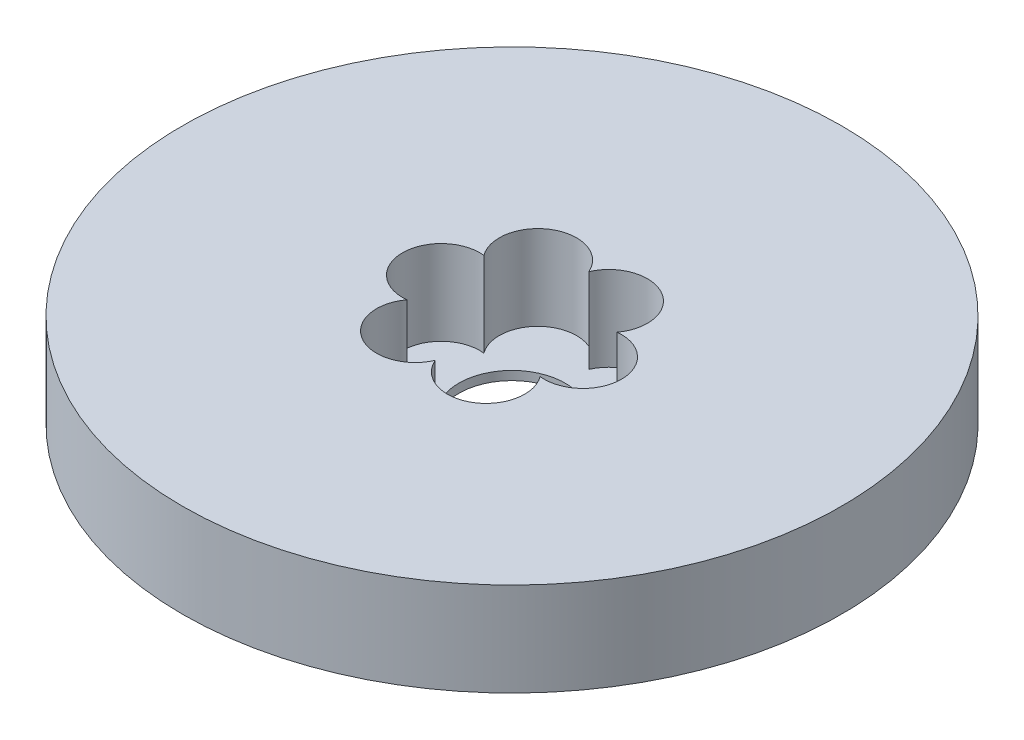
ISO-10303-21;
HEADER;
FILE_DESCRIPTION(('STEP AP214'),'2;1');
FILE_NAME('part.step','',(''),(''),'','','');
FILE_SCHEMA(('AUTOMOTIVE_DESIGN { 1 0 10303 214 1 1 1 1 }'));
ENDSEC;
DATA;
#1=APPLICATION_CONTEXT('core data for automotive mechanical design processes');
#2=APPLICATION_PROTOCOL_DEFINITION('international standard','automotive_design',2000,#1);
#3=PRODUCT_CONTEXT('',#1,'mechanical');
#4=PRODUCT('Part','Part','',(#3));
#5=PRODUCT_RELATED_PRODUCT_CATEGORY('part','',(#4));
#6=PRODUCT_DEFINITION_FORMATION('','',#4);
#7=PRODUCT_DEFINITION_CONTEXT('part definition',#1,'design');
#8=PRODUCT_DEFINITION('design','',#6,#7);
#9=PRODUCT_DEFINITION_SHAPE('','',#8);
#10=(LENGTH_UNIT() NAMED_UNIT(*) SI_UNIT(.MILLI.,.METRE.));
#11=(NAMED_UNIT(*) PLANE_ANGLE_UNIT() SI_UNIT($,.RADIAN.));
#12=(NAMED_UNIT(*) SI_UNIT($,.STERADIAN.) SOLID_ANGLE_UNIT());
#13=UNCERTAINTY_MEASURE_WITH_UNIT(LENGTH_MEASURE(1.E-05),#10,'distance_accuracy_value','');
#14=(GEOMETRIC_REPRESENTATION_CONTEXT(3) GLOBAL_UNCERTAINTY_ASSIGNED_CONTEXT((#13)) GLOBAL_UNIT_ASSIGNED_CONTEXT((#10,
#11,#12)) REPRESENTATION_CONTEXT('',''));
#15=CARTESIAN_POINT('',(0.,0.,0.));
#16=DIRECTION('',(0.,0.,1.));
#17=DIRECTION('',(1.,0.,0.));
#18=AXIS2_PLACEMENT_3D('',#15,#16,#17);
#19=CARTESIAN_POINT('',(0.,22.,0.));
#20=DIRECTION('',(0.,-1.,0.));
#21=DIRECTION('',(0.,0.,-1.));
#22=AXIS2_PLACEMENT_3D('',#19,#20,#21);
#23=CYLINDRICAL_SURFACE('',#22,12.5);
#24=CARTESIAN_POINT('',(0.,0.,0.));
#25=DIRECTION('',(0.,1.,0.));
#26=DIRECTION('',(0.,0.,1.));
#27=AXIS2_PLACEMENT_3D('',#24,#25,#26);
#28=CIRCLE('',#27,12.5);
#29=CARTESIAN_POINT('',(0.,0.,12.5));
#30=VERTEX_POINT('',#29);
#31=EDGE_CURVE('E142',#30,#30,#28,.T.);
#32=ORIENTED_EDGE('',*,*,#31,.F.);
#33=EDGE_LOOP('',(#32));
#34=FACE_BOUND('',#33,.T.);
#35=CARTESIAN_POINT('',(0.,2.08446523954327,0.));
#36=DIRECTION('',(0.,1.,0.));
#37=DIRECTION('',(0.,0.,1.));
#38=AXIS2_PLACEMENT_3D('',#35,#36,#37);
#39=CIRCLE('',#38,12.5);
#40=CARTESIAN_POINT('',(0.,2.08446523954327,12.5));
#41=VERTEX_POINT('',#40);
#42=EDGE_CURVE('E11',#41,#41,#39,.T.);
#43=ORIENTED_EDGE('',*,*,#42,.T.);
#44=EDGE_LOOP('',(#43));
#45=FACE_BOUND('',#44,.T.);
#46=ADVANCED_FACE('F39',(#34,#45),#23,.F.);
#47=CARTESIAN_POINT('',(0.,22.,0.));
#48=DIRECTION('',(0.,-1.,0.));
#49=DIRECTION('',(0.,0.,-1.));
#50=AXIS2_PLACEMENT_3D('',#47,#48,#49);
#51=CYLINDRICAL_SURFACE('',#50,77.5);
#52=CARTESIAN_POINT('',(0.,22.,0.));
#53=DIRECTION('',(0.,1.,0.));
#54=DIRECTION('',(0.,0.,1.));
#55=AXIS2_PLACEMENT_3D('',#52,#53,#54);
#56=CIRCLE('',#55,77.5);
#57=CARTESIAN_POINT('',(0.,22.,77.5));
#58=VERTEX_POINT('',#57);
#59=EDGE_CURVE('E50',#58,#58,#56,.T.);
#60=ORIENTED_EDGE('',*,*,#59,.F.);
#61=EDGE_LOOP('',(#60));
#62=FACE_BOUND('',#61,.T.);
#63=CARTESIAN_POINT('',(0.,0.,0.));
#64=DIRECTION('',(0.,1.,0.));
#65=DIRECTION('',(0.,0.,1.));
#66=AXIS2_PLACEMENT_3D('',#63,#64,#65);
#67=CIRCLE('',#66,77.5);
#68=CARTESIAN_POINT('',(0.,0.,77.5));
#69=VERTEX_POINT('',#68);
#70=EDGE_CURVE('E150',#69,#69,#67,.T.);
#71=ORIENTED_EDGE('',*,*,#70,.T.);
#72=EDGE_LOOP('',(#71));
#73=FACE_BOUND('',#72,.T.);
#74=ADVANCED_FACE('F41',(#62,#73),#51,.T.);
#75=CARTESIAN_POINT('',(0.,22.,0.));
#76=DIRECTION('',(0.,1.,0.));
#77=DIRECTION('',(0.,0.,1.));
#78=AXIS2_PLACEMENT_3D('',#75,#76,#77);
#79=PLANE('',#78);
#80=CARTESIAN_POINT('',(-8.3312481409689,22.,14.430145070622));
#81=DIRECTION('',(0.,1.,0.));
#82=DIRECTION('',(0.86602540378444,0.,0.499999999999998));
#83=AXIS2_PLACEMENT_3D('',#80,#81,#82);
#84=CIRCLE('',#83,9.09454067185579);
#85=CARTESIAN_POINT('',(-15.6553102485582,22.,9.03859758625219));
#86=VERTEX_POINT('',#85);
#87=CARTESIAN_POINT('',(0.,22.,18.0771951725044));
#88=VERTEX_POINT('',#87);
#89=EDGE_CURVE('E132',#86,#88,#84,.T.);
#90=ORIENTED_EDGE('',*,*,#89,.F.);
#91=CARTESIAN_POINT('',(-16.6624962819379,22.,0.));
#92=DIRECTION('',(0.,1.,0.));
#93=DIRECTION('',(0.,0.,1.));
#94=AXIS2_PLACEMENT_3D('',#91,#92,#93);
#95=CIRCLE('',#94,9.09454067185579);
#96=CARTESIAN_POINT('',(-15.6553102485585,22.,-9.03859758625224));
#97=VERTEX_POINT('',#96);
#98=EDGE_CURVE('E138',#97,#86,#95,.T.);
#99=ORIENTED_EDGE('',*,*,#98,.F.);
#100=CARTESIAN_POINT('',(-8.3312481409691,22.,-14.4301450706218));
#101=DIRECTION('',(0.,1.,0.));
#102=DIRECTION('',(-0.866025403784433,0.,0.50000000000001));
#103=AXIS2_PLACEMENT_3D('',#100,#101,#102);
#104=CIRCLE('',#103,9.09454067185579);
#105=CARTESIAN_POINT('',(-1.89084858881472E-13,22.,-18.0771951725044));
#106=VERTEX_POINT('',#105);
#107=EDGE_CURVE('E53',#106,#97,#104,.T.);
#108=ORIENTED_EDGE('',*,*,#107,.F.);
#109=CARTESIAN_POINT('',(8.33124814096879,22.,-14.430145070622));
#110=DIRECTION('',(0.,1.,0.));
#111=DIRECTION('',(-0.866025403784443,0.,-0.499999999999992));
#112=AXIS2_PLACEMENT_3D('',#109,#110,#111);
#113=CIRCLE('',#112,9.09454067185579);
#114=CARTESIAN_POINT('',(15.655310248558,22.,-9.03859758625218));
#115=VERTEX_POINT('',#114);
#116=EDGE_CURVE('E106',#115,#106,#113,.T.);
#117=ORIENTED_EDGE('',*,*,#116,.F.);
#118=CARTESIAN_POINT('',(16.6624962819379,22.,0.));
#119=DIRECTION('',(0.,1.,0.));
#120=DIRECTION('',(0.,0.,-1.));
#121=AXIS2_PLACEMENT_3D('',#118,#119,#120);
#122=CIRCLE('',#121,9.09454067185579);
#123=CARTESIAN_POINT('',(15.6553102485583,22.,9.03859758625222));
#124=VERTEX_POINT('',#123);
#125=EDGE_CURVE('E104',#124,#115,#122,.T.);
#126=ORIENTED_EDGE('',*,*,#125,.F.);
#127=CARTESIAN_POINT('',(8.331248140969,22.,14.4301450706219));
#128=DIRECTION('',(0.,1.,0.));
#129=DIRECTION('',(0.866025403784436,0.,-0.500000000000004));
#130=AXIS2_PLACEMENT_3D('',#127,#128,#129);
#131=CIRCLE('',#130,9.09454067185579);
#132=EDGE_CURVE('E123',#88,#124,#131,.T.);
#133=ORIENTED_EDGE('',*,*,#132,.F.);
#134=EDGE_LOOP('',(#90,#99,#108,#117,#126,#133));
#135=FACE_BOUND('',#134,.T.);
#136=ORIENTED_EDGE('',*,*,#59,.T.);
#137=EDGE_LOOP('',(#136));
#138=FACE_BOUND('',#137,.T.);
#139=ADVANCED_FACE('F156',(#135,#138),#79,.T.);
#140=CARTESIAN_POINT('',(0.,0.,0.));
#141=DIRECTION('',(0.,1.,0.));
#142=DIRECTION('',(0.,0.,1.));
#143=AXIS2_PLACEMENT_3D('',#140,#141,#142);
#144=PLANE('',#143);
#145=ORIENTED_EDGE('',*,*,#31,.T.);
#146=EDGE_LOOP('',(#145));
#147=FACE_BOUND('',#146,.T.);
#148=ORIENTED_EDGE('',*,*,#70,.F.);
#149=EDGE_LOOP('',(#148));
#150=FACE_BOUND('',#149,.T.);
#151=ADVANCED_FACE('F153',(#147,#150),#144,.F.);
#152=CARTESIAN_POINT('',(-16.6624962819379,2.08446523954327,0.));
#153=DIRECTION('',(0.,1.,0.));
#154=DIRECTION('',(0.,0.,1.));
#155=AXIS2_PLACEMENT_3D('',#152,#153,#154);
#156=CYLINDRICAL_SURFACE('',#155,9.09454067185579);
#157=ORIENTED_EDGE('',*,*,#98,.T.);
#158=DIRECTION('',(0.,1.,0.));
#159=VECTOR('',#158,1.);
#160=CARTESIAN_POINT('',(-15.6553102485582,12.0422326197716,9.0385975862522));
#161=LINE('',#160,#159);
#162=CARTESIAN_POINT('',(-15.6553102485582,2.08446523954327,9.0385975862522));
#163=VERTEX_POINT('',#162);
#164=EDGE_CURVE('E65',#86,#163,#161,.F.);
#165=ORIENTED_EDGE('',*,*,#164,.T.);
#166=CARTESIAN_POINT('',(-16.6624962819379,2.08446523954327,0.));
#167=DIRECTION('',(0.,1.,0.));
#168=DIRECTION('',(0.,0.,1.));
#169=AXIS2_PLACEMENT_3D('',#166,#167,#168);
#170=CIRCLE('',#169,9.09454067185579);
#171=CARTESIAN_POINT('',(-15.6553102485585,2.08446523954327,-9.03859758625223));
#172=VERTEX_POINT('',#171);
#173=EDGE_CURVE('E139',#172,#163,#170,.T.);
#174=ORIENTED_EDGE('',*,*,#173,.F.);
#175=DIRECTION('',(0.,1.,0.));
#176=VECTOR('',#175,1.);
#177=CARTESIAN_POINT('',(-15.6553102485585,12.0422326197716,-9.03859758625223));
#178=LINE('',#177,#176);
#179=EDGE_CURVE('E114',#172,#97,#178,.T.);
#180=ORIENTED_EDGE('',*,*,#179,.T.);
#181=EDGE_LOOP('',(#157,#165,#174,#180));
#182=FACE_BOUND('',#181,.T.);
#183=ADVANCED_FACE('F154',(#182),#156,.F.);
#184=CARTESIAN_POINT('',(-16.6624962819379,2.08446523954327,0.));
#185=DIRECTION('',(0.,1.,0.));
#186=DIRECTION('',(0.,0.,1.));
#187=AXIS2_PLACEMENT_3D('',#184,#185,#186);
#188=PLANE('',#187);
#189=ORIENTED_EDGE('',*,*,#173,.T.);
#190=CARTESIAN_POINT('',(-8.3312481409689,2.08446523954327,14.430145070622));
#191=DIRECTION('',(0.,1.,0.));
#192=DIRECTION('',(0.86602540378444,0.,0.499999999999998));
#193=AXIS2_PLACEMENT_3D('',#190,#191,#192);
#194=CIRCLE('',#193,9.09454067185579);
#195=CARTESIAN_POINT('',(0.,2.08446523954327,18.0771951725044));
#196=VERTEX_POINT('',#195);
#197=EDGE_CURVE('E133',#163,#196,#194,.T.);
#198=ORIENTED_EDGE('',*,*,#197,.T.);
#199=CARTESIAN_POINT('',(8.331248140969,2.08446523954327,14.4301450706219));
#200=DIRECTION('',(0.,1.,0.));
#201=DIRECTION('',(0.866025403784436,0.,-0.500000000000004));
#202=AXIS2_PLACEMENT_3D('',#199,#200,#201);
#203=CIRCLE('',#202,9.09454067185579);
#204=CARTESIAN_POINT('',(15.6553102485583,2.08446523954327,9.03859758625222));
#205=VERTEX_POINT('',#204);
#206=EDGE_CURVE('E124',#196,#205,#203,.T.);
#207=ORIENTED_EDGE('',*,*,#206,.T.);
#208=CARTESIAN_POINT('',(16.6624962819379,2.08446523954327,0.));
#209=DIRECTION('',(0.,1.,0.));
#210=DIRECTION('',(0.,0.,-1.));
#211=AXIS2_PLACEMENT_3D('',#208,#209,#210);
#212=CIRCLE('',#211,9.09454067185579);
#213=CARTESIAN_POINT('',(15.655310248558,2.08446523954327,-9.03859758625218));
#214=VERTEX_POINT('',#213);
#215=EDGE_CURVE('E105',#205,#214,#212,.T.);
#216=ORIENTED_EDGE('',*,*,#215,.T.);
#217=CARTESIAN_POINT('',(8.33124814096879,2.08446523954327,-14.430145070622));
#218=DIRECTION('',(0.,1.,0.));
#219=DIRECTION('',(-0.866025403784443,0.,-0.499999999999992));
#220=AXIS2_PLACEMENT_3D('',#217,#218,#219);
#221=CIRCLE('',#220,9.09454067185579);
#222=CARTESIAN_POINT('',(-1.89084858881472E-13,2.08446523954327,-18.0771951725044));
#223=VERTEX_POINT('',#222);
#224=EDGE_CURVE('E91',#214,#223,#221,.T.);
#225=ORIENTED_EDGE('',*,*,#224,.T.);
#226=CARTESIAN_POINT('',(-8.3312481409691,2.08446523954327,-14.4301450706218));
#227=DIRECTION('',(0.,1.,0.));
#228=DIRECTION('',(-0.866025403784433,0.,0.50000000000001));
#229=AXIS2_PLACEMENT_3D('',#226,#227,#228);
#230=CIRCLE('',#229,9.09454067185579);
#231=EDGE_CURVE('E97',#223,#172,#230,.T.);
#232=ORIENTED_EDGE('',*,*,#231,.T.);
#233=EDGE_LOOP('',(#189,#198,#207,#216,#225,#232));
#234=FACE_BOUND('',#233,.T.);
#235=ORIENTED_EDGE('',*,*,#42,.F.);
#236=EDGE_LOOP('',(#235));
#237=FACE_BOUND('',#236,.T.);
#238=ADVANCED_FACE('F96',(#234,#237),#188,.T.);
#239=CARTESIAN_POINT('',(-8.3312481409689,2.08446523954327,14.430145070622));
#240=DIRECTION('',(0.,1.,0.));
#241=DIRECTION('',(0.,0.,1.));
#242=AXIS2_PLACEMENT_3D('',#239,#240,#241);
#243=CYLINDRICAL_SURFACE('',#242,9.09454067185579);
#244=ORIENTED_EDGE('',*,*,#89,.T.);
#245=DIRECTION('',(0.,1.,0.));
#246=VECTOR('',#245,1.);
#247=CARTESIAN_POINT('',(0.,12.0422326197716,18.0771951725044));
#248=LINE('',#247,#246);
#249=EDGE_CURVE('E128',#88,#196,#248,.F.);
#250=ORIENTED_EDGE('',*,*,#249,.T.);
#251=ORIENTED_EDGE('',*,*,#197,.F.);
#252=ORIENTED_EDGE('',*,*,#164,.F.);
#253=EDGE_LOOP('',(#244,#250,#251,#252));
#254=FACE_BOUND('',#253,.T.);
#255=ADVANCED_FACE('F177',(#254),#243,.F.);
#256=CARTESIAN_POINT('',(-8.3312481409691,2.08446523954327,-14.4301450706218));
#257=DIRECTION('',(0.,1.,0.));
#258=DIRECTION('',(0.,0.,1.));
#259=AXIS2_PLACEMENT_3D('',#256,#257,#258);
#260=CYLINDRICAL_SURFACE('',#259,9.09454067185579);
#261=ORIENTED_EDGE('',*,*,#231,.F.);
#262=DIRECTION('',(0.,1.,0.));
#263=VECTOR('',#262,1.);
#264=CARTESIAN_POINT('',(-1.89084858881472E-13,12.0422326197716,-18.0771951725044));
#265=LINE('',#264,#263);
#266=EDGE_CURVE('E107',#106,#223,#265,.F.);
#267=ORIENTED_EDGE('',*,*,#266,.F.);
#268=ORIENTED_EDGE('',*,*,#107,.T.);
#269=ORIENTED_EDGE('',*,*,#179,.F.);
#270=EDGE_LOOP('',(#261,#267,#268,#269));
#271=FACE_BOUND('',#270,.T.);
#272=ADVANCED_FACE('F115',(#271),#260,.F.);
#273=CARTESIAN_POINT('',(8.331248140969,2.08446523954327,14.4301450706219));
#274=DIRECTION('',(0.,1.,0.));
#275=DIRECTION('',(0.,0.,1.));
#276=AXIS2_PLACEMENT_3D('',#273,#274,#275);
#277=CYLINDRICAL_SURFACE('',#276,9.09454067185579);
#278=ORIENTED_EDGE('',*,*,#132,.T.);
#279=DIRECTION('',(0.,1.,0.));
#280=VECTOR('',#279,1.);
#281=CARTESIAN_POINT('',(15.6553102485583,12.0422326197716,9.03859758625222));
#282=LINE('',#281,#280);
#283=EDGE_CURVE('E118',#124,#205,#282,.F.);
#284=ORIENTED_EDGE('',*,*,#283,.T.);
#285=ORIENTED_EDGE('',*,*,#206,.F.);
#286=ORIENTED_EDGE('',*,*,#249,.F.);
#287=EDGE_LOOP('',(#278,#284,#285,#286));
#288=FACE_BOUND('',#287,.T.);
#289=ADVANCED_FACE('F182',(#288),#277,.F.);
#290=CARTESIAN_POINT('',(16.6624962819379,2.08446523954327,0.));
#291=DIRECTION('',(0.,1.,0.));
#292=DIRECTION('',(0.,0.,1.));
#293=AXIS2_PLACEMENT_3D('',#290,#291,#292);
#294=CYLINDRICAL_SURFACE('',#293,9.09454067185579);
#295=DIRECTION('',(0.,1.,0.));
#296=VECTOR('',#295,1.);
#297=CARTESIAN_POINT('',(15.655310248558,12.0422326197716,-9.03859758625218));
#298=LINE('',#297,#296);
#299=EDGE_CURVE('E130',#115,#214,#298,.F.);
#300=ORIENTED_EDGE('',*,*,#299,.T.);
#301=ORIENTED_EDGE('',*,*,#215,.F.);
#302=ORIENTED_EDGE('',*,*,#283,.F.);
#303=ORIENTED_EDGE('',*,*,#125,.T.);
#304=EDGE_LOOP('',(#300,#301,#302,#303));
#305=FACE_BOUND('',#304,.T.);
#306=ADVANCED_FACE('F184',(#305),#294,.F.);
#307=CARTESIAN_POINT('',(8.33124814096879,2.08446523954327,-14.430145070622));
#308=DIRECTION('',(0.,1.,0.));
#309=DIRECTION('',(0.,0.,1.));
#310=AXIS2_PLACEMENT_3D('',#307,#308,#309);
#311=CYLINDRICAL_SURFACE('',#310,9.09454067185579);
#312=ORIENTED_EDGE('',*,*,#116,.T.);
#313=ORIENTED_EDGE('',*,*,#266,.T.);
#314=ORIENTED_EDGE('',*,*,#224,.F.);
#315=ORIENTED_EDGE('',*,*,#299,.F.);
#316=EDGE_LOOP('',(#312,#313,#314,#315));
#317=FACE_BOUND('',#316,.T.);
#318=ADVANCED_FACE('F108',(#317),#311,.F.);
#319=CLOSED_SHELL('',(#46,#74,#139,#151,#183,#238,#255,#272,#289,#306,#318));
#320=MANIFOLD_SOLID_BREP('B2',#319);
#321=ADVANCED_BREP_SHAPE_REPRESENTATION('',(#18,#320),#14);
#322=SHAPE_DEFINITION_REPRESENTATION(#9,#321);
ENDSEC;
END-ISO-10303-21;
